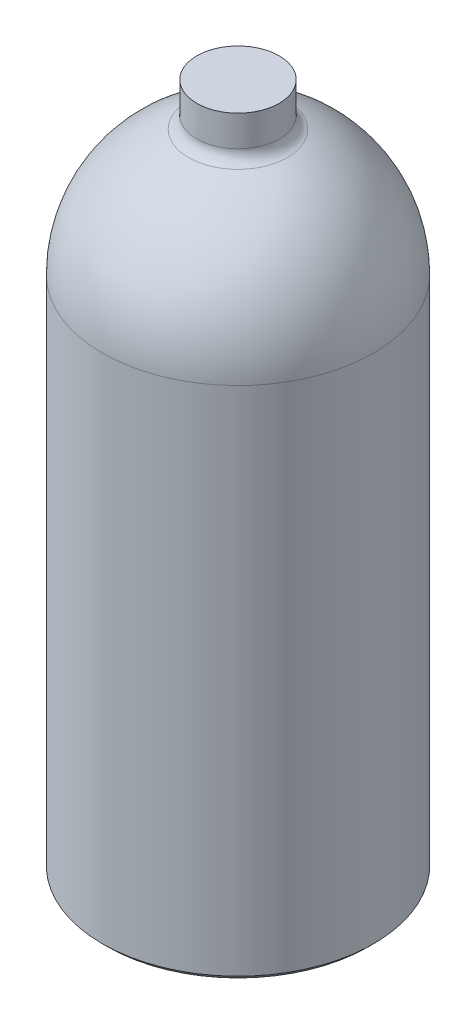
ISO-10303-21;
HEADER;
FILE_DESCRIPTION(('STEP AP214'),'2;1');
FILE_NAME('part.step','',(''),(''),'','','');
FILE_SCHEMA(('AUTOMOTIVE_DESIGN { 1 0 10303 214 1 1 1 1 }'));
ENDSEC;
DATA;
#1=APPLICATION_CONTEXT('core data for automotive mechanical design processes');
#2=APPLICATION_PROTOCOL_DEFINITION('international standard','automotive_design',2000,#1);
#3=PRODUCT_CONTEXT('',#1,'mechanical');
#4=PRODUCT('Part','Part','',(#3));
#5=PRODUCT_RELATED_PRODUCT_CATEGORY('part','',(#4));
#6=PRODUCT_DEFINITION_FORMATION('','',#4);
#7=PRODUCT_DEFINITION_CONTEXT('part definition',#1,'design');
#8=PRODUCT_DEFINITION('design','',#6,#7);
#9=PRODUCT_DEFINITION_SHAPE('','',#8);
#10=(LENGTH_UNIT() NAMED_UNIT(*) SI_UNIT(.MILLI.,.METRE.));
#11=(NAMED_UNIT(*) PLANE_ANGLE_UNIT() SI_UNIT($,.RADIAN.));
#12=(NAMED_UNIT(*) SI_UNIT($,.STERADIAN.) SOLID_ANGLE_UNIT());
#13=UNCERTAINTY_MEASURE_WITH_UNIT(LENGTH_MEASURE(1.E-05),#10,'distance_accuracy_value','');
#14=(GEOMETRIC_REPRESENTATION_CONTEXT(3) GLOBAL_UNCERTAINTY_ASSIGNED_CONTEXT((#13)) GLOBAL_UNIT_ASSIGNED_CONTEXT((#10,
#11,#12)) REPRESENTATION_CONTEXT('',''));
#15=CARTESIAN_POINT('',(0.,0.,0.));
#16=DIRECTION('',(0.,0.,1.));
#17=DIRECTION('',(1.,0.,0.));
#18=AXIS2_PLACEMENT_3D('',#15,#16,#17);
#19=CARTESIAN_POINT('',(0.,127.0635,0.));
#20=DIRECTION('',(0.,0.,1.));
#21=DIRECTION('',(1.,0.,0.));
#22=AXIS2_PLACEMENT_3D('',#19,#20,#21);
#23=SPHERICAL_SURFACE('',#22,66.675);
#24=CARTESIAN_POINT('',(0.,127.0635,0.));
#25=DIRECTION('',(0.,-1.,0.));
#26=DIRECTION('',(0.,0.,-1.));
#27=AXIS2_PLACEMENT_3D('',#24,#25,#26);
#28=SPHERICAL_SURFACE('',#27,66.675);
#29=CARTESIAN_POINT('',(0.,189.155992272394,0.));
#30=DIRECTION('',(0.,-1.,0.));
#31=DIRECTION('',(0.,0.,-1.));
#32=AXIS2_PLACEMENT_3D('',#29,#30,#31);
#33=CIRCLE('',#32,24.2915217391304);
#34=CARTESIAN_POINT('',(0.,189.155992272394,-24.2915217391304));
#35=VERTEX_POINT('',#34);
#36=EDGE_CURVE('E47',#35,#35,#33,.T.);
#37=ORIENTED_EDGE('',*,*,#36,.T.);
#38=EDGE_LOOP('',(#37));
#39=FACE_BOUND('',#38,.T.);
#40=CARTESIAN_POINT('',(0.,127.0635,0.));
#41=DIRECTION('',(0.,1.,0.));
#42=DIRECTION('',(0.,0.,1.));
#43=AXIS2_PLACEMENT_3D('',#40,#41,#42);
#44=CIRCLE('',#43,66.675);
#45=CARTESIAN_POINT('',(0.,127.0635,66.675));
#46=VERTEX_POINT('',#45);
#47=EDGE_CURVE('E63',#46,#46,#44,.T.);
#48=ORIENTED_EDGE('',*,*,#47,.T.);
#49=EDGE_LOOP('',(#48));
#50=FACE_BOUND('',#49,.T.);
#51=ADVANCED_FACE('F39',(#39,#50),#28,.T.);
#52=CARTESIAN_POINT('',(0.,127.0635,0.));
#53=DIRECTION('',(0.,-1.,0.));
#54=DIRECTION('',(0.,0.,-1.));
#55=AXIS2_PLACEMENT_3D('',#52,#53,#54);
#56=CYLINDRICAL_SURFACE('',#55,66.675);
#57=CARTESIAN_POINT('',(0.,-124.5235,0.));
#58=DIRECTION('',(0.,1.,0.));
#59=DIRECTION('',(0.,0.,1.));
#60=AXIS2_PLACEMENT_3D('',#57,#58,#59);
#61=CIRCLE('',#60,66.675);
#62=CARTESIAN_POINT('',(0.,-124.5235,66.675));
#63=VERTEX_POINT('',#62);
#64=EDGE_CURVE('E57',#63,#63,#61,.T.);
#65=ORIENTED_EDGE('',*,*,#64,.T.);
#66=EDGE_LOOP('',(#65));
#67=FACE_BOUND('',#66,.T.);
#68=ORIENTED_EDGE('',*,*,#47,.F.);
#69=EDGE_LOOP('',(#68));
#70=FACE_BOUND('',#69,.T.);
#71=ADVANCED_FACE('F84',(#67,#70),#56,.T.);
#72=CARTESIAN_POINT('',(0.,-127.0635,0.));
#73=DIRECTION('',(0.,1.,0.));
#74=DIRECTION('',(0.,0.,1.));
#75=AXIS2_PLACEMENT_3D('',#72,#73,#74);
#76=PLANE('',#75);
#77=CARTESIAN_POINT('',(0.,-127.0635,0.));
#78=DIRECTION('',(0.,1.,0.));
#79=DIRECTION('',(0.,0.,1.));
#80=AXIS2_PLACEMENT_3D('',#77,#78,#79);
#81=CIRCLE('',#80,64.135);
#82=CARTESIAN_POINT('',(0.,-127.0635,64.135));
#83=VERTEX_POINT('',#82);
#84=EDGE_CURVE('E52',#83,#83,#81,.F.);
#85=ORIENTED_EDGE('',*,*,#84,.T.);
#86=EDGE_LOOP('',(#85));
#87=FACE_BOUND('',#86,.T.);
#88=ADVANCED_FACE('F76',(#87),#76,.F.);
#89=CARTESIAN_POINT('',(0.,210.2485,0.));
#90=DIRECTION('',(0.,-1.,0.));
#91=DIRECTION('',(0.,0.,-1.));
#92=AXIS2_PLACEMENT_3D('',#89,#90,#91);
#93=CYLINDRICAL_SURFACE('',#92,20.255);
#94=CARTESIAN_POINT('',(0.,195.069562965003,0.));
#95=DIRECTION('',(0.,-1.,0.));
#96=DIRECTION('',(0.,0.,-1.));
#97=AXIS2_PLACEMENT_3D('',#94,#95,#96);
#98=CIRCLE('',#97,20.255);
#99=CARTESIAN_POINT('',(0.,195.069562965003,-20.255));
#100=VERTEX_POINT('',#99);
#101=EDGE_CURVE('E10',#100,#100,#98,.F.);
#102=ORIENTED_EDGE('',*,*,#101,.T.);
#103=EDGE_LOOP('',(#102));
#104=FACE_BOUND('',#103,.T.);
#105=CARTESIAN_POINT('',(0.,210.2485,0.));
#106=DIRECTION('',(0.,1.,0.));
#107=DIRECTION('',(0.,0.,1.));
#108=AXIS2_PLACEMENT_3D('',#105,#106,#107);
#109=CIRCLE('',#108,20.255);
#110=CARTESIAN_POINT('',(0.,210.2485,20.255));
#111=VERTEX_POINT('',#110);
#112=EDGE_CURVE('E67',#111,#111,#109,.T.);
#113=ORIENTED_EDGE('',*,*,#112,.F.);
#114=EDGE_LOOP('',(#113));
#115=FACE_BOUND('',#114,.T.);
#116=ADVANCED_FACE('F74',(#104,#115),#93,.T.);
#117=CARTESIAN_POINT('',(0.,210.2485,0.));
#118=DIRECTION('',(0.,1.,0.));
#119=DIRECTION('',(0.,0.,1.));
#120=AXIS2_PLACEMENT_3D('',#117,#118,#119);
#121=PLANE('',#120);
#122=ORIENTED_EDGE('',*,*,#112,.T.);
#123=EDGE_LOOP('',(#122));
#124=FACE_BOUND('',#123,.T.);
#125=ADVANCED_FACE('F72',(#124),#121,.T.);
#126=CARTESIAN_POINT('',(0.,-124.5235,0.));
#127=DIRECTION('',(0.,1.,0.));
#128=DIRECTION('',(0.,0.,1.));
#129=AXIS2_PLACEMENT_3D('',#126,#127,#128);
#130=CONICAL_SURFACE('',#129,66.675,0.785398163397446);
#131=ORIENTED_EDGE('',*,*,#84,.F.);
#132=EDGE_LOOP('',(#131));
#133=FACE_BOUND('',#132,.T.);
#134=ORIENTED_EDGE('',*,*,#64,.F.);
#135=EDGE_LOOP('',(#134));
#136=FACE_BOUND('',#135,.T.);
#137=ADVANCED_FACE('F82',(#133,#136),#130,.T.);
#138=CARTESIAN_POINT('',(0.,195.069562965003,0.));
#139=DIRECTION('',(0.,-1.,0.));
#140=DIRECTION('',(0.,0.,-1.));
#141=AXIS2_PLACEMENT_3D('',#138,#139,#140);
#142=TOROIDAL_SURFACE('',#141,26.605,6.35);
#143=ORIENTED_EDGE('',*,*,#101,.F.);
#144=EDGE_LOOP('',(#143));
#145=FACE_BOUND('',#144,.T.);
#146=ORIENTED_EDGE('',*,*,#36,.F.);
#147=EDGE_LOOP('',(#146));
#148=FACE_BOUND('',#147,.T.);
#149=ADVANCED_FACE('F41',(#145,#148),#142,.F.);
#150=CLOSED_SHELL('',(#51,#71,#88,#116,#125,#137,#149));
#151=MANIFOLD_SOLID_BREP('B2',#150);
#152=ADVANCED_BREP_SHAPE_REPRESENTATION('',(#18,#151),#14);
#153=SHAPE_DEFINITION_REPRESENTATION(#9,#152);
ENDSEC;
END-ISO-10303-21;
